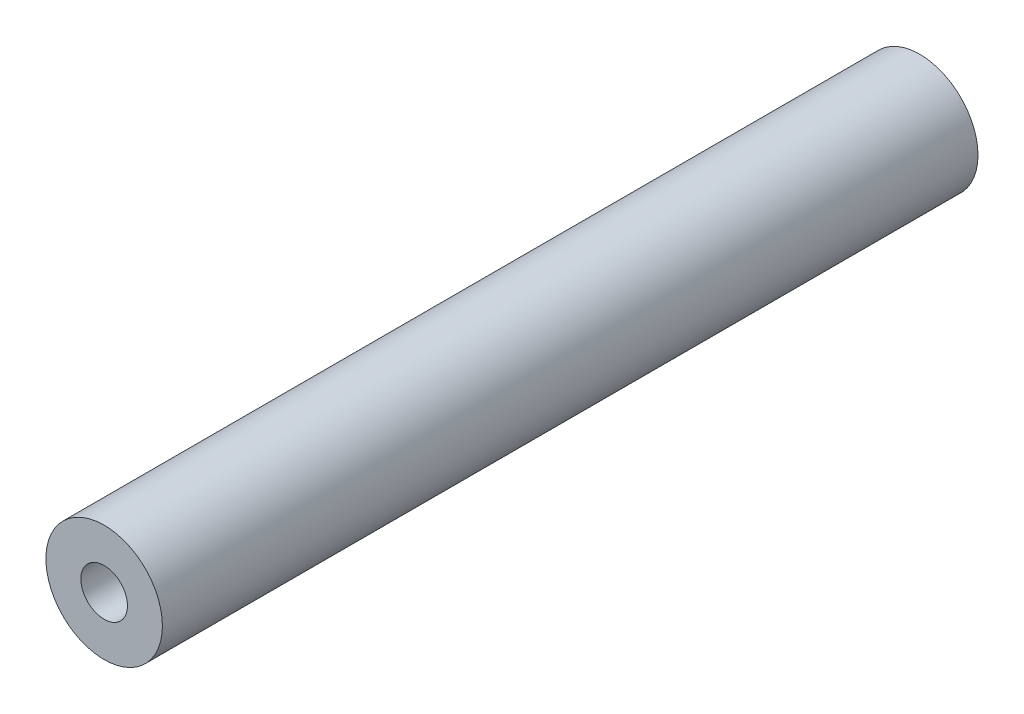
ISO-10303-21;
HEADER;
FILE_DESCRIPTION(('STEP AP214'),'2;1');
FILE_NAME('part.step','',(''),(''),'','','');
FILE_SCHEMA(('AUTOMOTIVE_DESIGN { 1 0 10303 214 1 1 1 1 }'));
ENDSEC;
DATA;
#1=APPLICATION_CONTEXT('core data for automotive mechanical design processes');
#2=APPLICATION_PROTOCOL_DEFINITION('international standard','automotive_design',2000,#1);
#3=PRODUCT_CONTEXT('',#1,'mechanical');
#4=PRODUCT('Part','Part','',(#3));
#5=PRODUCT_RELATED_PRODUCT_CATEGORY('part','',(#4));
#6=PRODUCT_DEFINITION_FORMATION('','',#4);
#7=PRODUCT_DEFINITION_CONTEXT('part definition',#1,'design');
#8=PRODUCT_DEFINITION('design','',#6,#7);
#9=PRODUCT_DEFINITION_SHAPE('','',#8);
#10=(LENGTH_UNIT() NAMED_UNIT(*) SI_UNIT(.MILLI.,.METRE.));
#11=(NAMED_UNIT(*) PLANE_ANGLE_UNIT() SI_UNIT($,.RADIAN.));
#12=(NAMED_UNIT(*) SI_UNIT($,.STERADIAN.) SOLID_ANGLE_UNIT());
#13=UNCERTAINTY_MEASURE_WITH_UNIT(LENGTH_MEASURE(1.E-05),#10,'distance_accuracy_value','');
#14=(GEOMETRIC_REPRESENTATION_CONTEXT(3) GLOBAL_UNCERTAINTY_ASSIGNED_CONTEXT((#13)) GLOBAL_UNIT_ASSIGNED_CONTEXT((#10,
#11,#12)) REPRESENTATION_CONTEXT('',''));
#15=CARTESIAN_POINT('',(0.,0.,0.));
#16=DIRECTION('',(0.,0.,1.));
#17=DIRECTION('',(1.,0.,0.));
#18=AXIS2_PLACEMENT_3D('',#15,#16,#17);
#19=CARTESIAN_POINT('',(0.,0.,70.));
#20=DIRECTION('',(0.,0.,1.));
#21=DIRECTION('',(1.,0.,0.));
#22=AXIS2_PLACEMENT_3D('',#19,#20,#21);
#23=PLANE('',#22);
#24=CARTESIAN_POINT('',(0.,0.,70.));
#25=DIRECTION('',(0.,0.,1.));
#26=DIRECTION('',(1.,0.,0.));
#27=AXIS2_PLACEMENT_3D('',#24,#25,#26);
#28=CIRCLE('',#27,5.);
#29=CARTESIAN_POINT('',(5.,0.,70.));
#30=VERTEX_POINT('',#29);
#31=EDGE_CURVE('E10',#30,#30,#28,.T.);
#32=ORIENTED_EDGE('',*,*,#31,.T.);
#33=EDGE_LOOP('',(#32));
#34=FACE_BOUND('',#33,.T.);
#35=CARTESIAN_POINT('',(0.,0.,70.));
#36=DIRECTION('',(0.,0.,1.));
#37=DIRECTION('',(1.,0.,0.));
#38=AXIS2_PLACEMENT_3D('',#35,#36,#37);
#39=CIRCLE('',#38,2.);
#40=CARTESIAN_POINT('',(2.,0.,70.));
#41=VERTEX_POINT('',#40);
#42=EDGE_CURVE('E46',#41,#41,#39,.T.);
#43=ORIENTED_EDGE('',*,*,#42,.F.);
#44=EDGE_LOOP('',(#43));
#45=FACE_BOUND('',#44,.T.);
#46=ADVANCED_FACE('F35',(#34,#45),#23,.T.);
#47=CARTESIAN_POINT('',(0.,0.,0.));
#48=DIRECTION('',(0.,0.,1.));
#49=DIRECTION('',(1.,0.,0.));
#50=AXIS2_PLACEMENT_3D('',#47,#48,#49);
#51=PLANE('',#50);
#52=CARTESIAN_POINT('',(0.,0.,0.));
#53=DIRECTION('',(0.,0.,1.));
#54=DIRECTION('',(1.,0.,0.));
#55=AXIS2_PLACEMENT_3D('',#52,#53,#54);
#56=CIRCLE('',#55,5.);
#57=CARTESIAN_POINT('',(5.,0.,0.));
#58=VERTEX_POINT('',#57);
#59=EDGE_CURVE('E39',#58,#58,#56,.T.);
#60=ORIENTED_EDGE('',*,*,#59,.F.);
#61=EDGE_LOOP('',(#60));
#62=FACE_BOUND('',#61,.T.);
#63=CARTESIAN_POINT('',(0.,0.,0.));
#64=DIRECTION('',(0.,0.,1.));
#65=DIRECTION('',(1.,0.,0.));
#66=AXIS2_PLACEMENT_3D('',#63,#64,#65);
#67=CIRCLE('',#66,2.);
#68=CARTESIAN_POINT('',(2.,0.,0.));
#69=VERTEX_POINT('',#68);
#70=EDGE_CURVE('E48',#69,#69,#67,.T.);
#71=ORIENTED_EDGE('',*,*,#70,.T.);
#72=EDGE_LOOP('',(#71));
#73=FACE_BOUND('',#72,.T.);
#74=ADVANCED_FACE('F58',(#62,#73),#51,.F.);
#75=CARTESIAN_POINT('',(0.,0.,70.));
#76=DIRECTION('',(0.,0.,-1.));
#77=DIRECTION('',(-1.,0.,0.));
#78=AXIS2_PLACEMENT_3D('',#75,#76,#77);
#79=CYLINDRICAL_SURFACE('',#78,5.);
#80=ORIENTED_EDGE('',*,*,#31,.F.);
#81=EDGE_LOOP('',(#80));
#82=FACE_BOUND('',#81,.T.);
#83=ORIENTED_EDGE('',*,*,#59,.T.);
#84=EDGE_LOOP('',(#83));
#85=FACE_BOUND('',#84,.T.);
#86=ADVANCED_FACE('F37',(#82,#85),#79,.T.);
#87=CARTESIAN_POINT('',(0.,0.,70.));
#88=DIRECTION('',(0.,0.,-1.));
#89=DIRECTION('',(-1.,0.,0.));
#90=AXIS2_PLACEMENT_3D('',#87,#88,#89);
#91=CYLINDRICAL_SURFACE('',#90,2.);
#92=ORIENTED_EDGE('',*,*,#42,.T.);
#93=EDGE_LOOP('',(#92));
#94=FACE_BOUND('',#93,.T.);
#95=ORIENTED_EDGE('',*,*,#70,.F.);
#96=EDGE_LOOP('',(#95));
#97=FACE_BOUND('',#96,.T.);
#98=ADVANCED_FACE('F54',(#94,#97),#91,.F.);
#99=CLOSED_SHELL('',(#46,#74,#86,#98));
#100=MANIFOLD_SOLID_BREP('B2',#99);
#101=ADVANCED_BREP_SHAPE_REPRESENTATION('',(#18,#100),#14);
#102=SHAPE_DEFINITION_REPRESENTATION(#9,#101);
ENDSEC;
END-ISO-10303-21;
